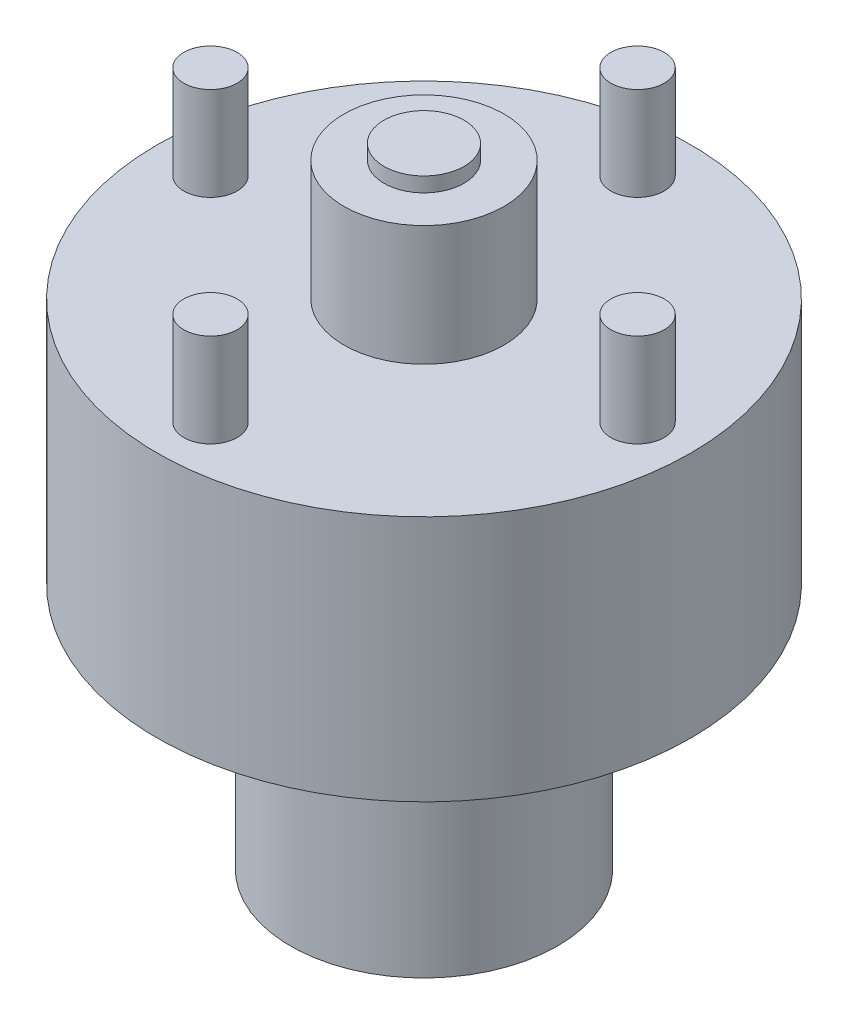
ISO-10303-21;
HEADER;
FILE_DESCRIPTION(('STEP AP214'),'2;1');
FILE_NAME('part.step','',(''),(''),'','','');
FILE_SCHEMA(('AUTOMOTIVE_DESIGN { 1 0 10303 214 1 1 1 1 }'));
ENDSEC;
DATA;
#1=APPLICATION_CONTEXT('core data for automotive mechanical design processes');
#2=APPLICATION_PROTOCOL_DEFINITION('international standard','automotive_design',2000,#1);
#3=PRODUCT_CONTEXT('',#1,'mechanical');
#4=PRODUCT('Part','Part','',(#3));
#5=PRODUCT_RELATED_PRODUCT_CATEGORY('part','',(#4));
#6=PRODUCT_DEFINITION_FORMATION('','',#4);
#7=PRODUCT_DEFINITION_CONTEXT('part definition',#1,'design');
#8=PRODUCT_DEFINITION('design','',#6,#7);
#9=PRODUCT_DEFINITION_SHAPE('','',#8);
#10=(LENGTH_UNIT() NAMED_UNIT(*) SI_UNIT(.MILLI.,.METRE.));
#11=(NAMED_UNIT(*) PLANE_ANGLE_UNIT() SI_UNIT($,.RADIAN.));
#12=(NAMED_UNIT(*) SI_UNIT($,.STERADIAN.) SOLID_ANGLE_UNIT());
#13=UNCERTAINTY_MEASURE_WITH_UNIT(LENGTH_MEASURE(1.E-05),#10,'distance_accuracy_value','');
#14=(GEOMETRIC_REPRESENTATION_CONTEXT(3) GLOBAL_UNCERTAINTY_ASSIGNED_CONTEXT((#13)) GLOBAL_UNIT_ASSIGNED_CONTEXT((#10,
#11,#12)) REPRESENTATION_CONTEXT('',''));
#15=CARTESIAN_POINT('',(0.,0.,0.));
#16=DIRECTION('',(0.,0.,1.));
#17=DIRECTION('',(1.,0.,0.));
#18=AXIS2_PLACEMENT_3D('',#15,#16,#17);
#19=CARTESIAN_POINT('',(0.,14.375,0.));
#20=DIRECTION('',(0.,1.,0.));
#21=DIRECTION('',(-1.,0.,0.));
#22=AXIS2_PLACEMENT_3D('',#19,#20,#21);
#23=PLANE('',#22);
#24=CARTESIAN_POINT('',(0.,14.375,0.));
#25=DIRECTION('',(0.,-1.,0.));
#26=DIRECTION('',(1.,0.,0.));
#27=AXIS2_PLACEMENT_3D('',#24,#25,#26);
#28=CIRCLE('',#27,1.5);
#29=CARTESIAN_POINT('',(1.5,14.375,0.));
#30=VERTEX_POINT('',#29);
#31=EDGE_CURVE('E10',#30,#30,#28,.T.);
#32=ORIENTED_EDGE('',*,*,#31,.F.);
#33=EDGE_LOOP('',(#32));
#34=FACE_BOUND('',#33,.T.);
#35=ADVANCED_FACE('F14',(#34),#23,.T.);
#36=CARTESIAN_POINT('',(0.,-4.325,0.));
#37=DIRECTION('',(0.,-1.,0.));
#38=DIRECTION('',(1.,0.,0.));
#39=AXIS2_PLACEMENT_3D('',#36,#37,#38);
#40=CYLINDRICAL_SURFACE('',#39,1.5);
#41=ORIENTED_EDGE('',*,*,#31,.T.);
#42=EDGE_LOOP('',(#41));
#43=FACE_BOUND('',#42,.T.);
#44=CARTESIAN_POINT('',(0.,13.825,0.));
#45=DIRECTION('',(0.,-1.,0.));
#46=DIRECTION('',(1.,0.,0.));
#47=AXIS2_PLACEMENT_3D('',#44,#45,#46);
#48=CIRCLE('',#47,1.5);
#49=CARTESIAN_POINT('',(1.5,13.825,0.));
#50=VERTEX_POINT('',#49);
#51=EDGE_CURVE('E26',#50,#50,#48,.T.);
#52=ORIENTED_EDGE('',*,*,#51,.F.);
#53=EDGE_LOOP('',(#52));
#54=FACE_BOUND('',#53,.T.);
#55=ADVANCED_FACE('F96',(#43,#54),#40,.T.);
#56=CARTESIAN_POINT('',(1.5,13.825,0.));
#57=DIRECTION('',(0.,1.,0.));
#58=DIRECTION('',(-1.,0.,0.));
#59=AXIS2_PLACEMENT_3D('',#56,#57,#58);
#60=PLANE('',#59);
#61=ORIENTED_EDGE('',*,*,#51,.T.);
#62=EDGE_LOOP('',(#61));
#63=FACE_BOUND('',#62,.T.);
#64=CARTESIAN_POINT('',(0.,13.825,0.));
#65=DIRECTION('',(0.,-1.,0.));
#66=DIRECTION('',(1.,0.,0.));
#67=AXIS2_PLACEMENT_3D('',#64,#65,#66);
#68=CIRCLE('',#67,3.);
#69=CARTESIAN_POINT('',(3.,13.825,0.));
#70=VERTEX_POINT('',#69);
#71=EDGE_CURVE('E30',#70,#70,#68,.T.);
#72=ORIENTED_EDGE('',*,*,#71,.F.);
#73=EDGE_LOOP('',(#72));
#74=FACE_BOUND('',#73,.T.);
#75=ADVANCED_FACE('F101',(#63,#74),#60,.T.);
#76=CARTESIAN_POINT('',(0.,-4.325,0.));
#77=DIRECTION('',(0.,-1.,0.));
#78=DIRECTION('',(1.,0.,0.));
#79=AXIS2_PLACEMENT_3D('',#76,#77,#78);
#80=CYLINDRICAL_SURFACE('',#79,3.);
#81=ORIENTED_EDGE('',*,*,#71,.T.);
#82=EDGE_LOOP('',(#81));
#83=FACE_BOUND('',#82,.T.);
#84=CARTESIAN_POINT('',(0.,9.325,0.));
#85=DIRECTION('',(0.,-1.,0.));
#86=DIRECTION('',(1.,0.,0.));
#87=AXIS2_PLACEMENT_3D('',#84,#85,#86);
#88=CIRCLE('',#87,3.);
#89=CARTESIAN_POINT('',(3.,9.325,0.));
#90=VERTEX_POINT('',#89);
#91=EDGE_CURVE('E35',#90,#90,#88,.T.);
#92=ORIENTED_EDGE('',*,*,#91,.F.);
#93=EDGE_LOOP('',(#92));
#94=FACE_BOUND('',#93,.T.);
#95=ADVANCED_FACE('F105',(#83,#94),#80,.T.);
#96=CARTESIAN_POINT('',(10.,9.325,0.));
#97=DIRECTION('',(0.,1.,0.));
#98=DIRECTION('',(-1.,0.,0.));
#99=AXIS2_PLACEMENT_3D('',#96,#97,#98);
#100=PLANE('',#99);
#101=CARTESIAN_POINT('',(8.,9.325,1.5144976769533E-13));
#102=DIRECTION('',(0.,1.,0.));
#103=DIRECTION('',(-1.,0.,0.));
#104=AXIS2_PLACEMENT_3D('',#101,#102,#103);
#105=CIRCLE('',#104,1.);
#106=CARTESIAN_POINT('',(7.,9.325,1.5144976769533E-13));
#107=VERTEX_POINT('',#106);
#108=EDGE_CURVE('E326',#107,#107,#105,.T.);
#109=ORIENTED_EDGE('',*,*,#108,.F.);
#110=EDGE_LOOP('',(#109));
#111=FACE_BOUND('',#110,.T.);
#112=CARTESIAN_POINT('',(1.21957625001815E-13,9.325,-8.));
#113=DIRECTION('',(0.,1.,0.));
#114=DIRECTION('',(-1.,0.,0.));
#115=AXIS2_PLACEMENT_3D('',#112,#113,#114);
#116=CIRCLE('',#115,1.);
#117=CARTESIAN_POINT('',(-0.999999999999878,9.325,-8.));
#118=VERTEX_POINT('',#117);
#119=EDGE_CURVE('E325',#118,#118,#116,.T.);
#120=ORIENTED_EDGE('',*,*,#119,.F.);
#121=EDGE_LOOP('',(#120));
#122=FACE_BOUND('',#121,.T.);
#123=CARTESIAN_POINT('',(-8.,9.325,0.));
#124=DIRECTION('',(0.,1.,0.));
#125=DIRECTION('',(-1.,0.,0.));
#126=AXIS2_PLACEMENT_3D('',#123,#124,#125);
#127=CIRCLE('',#126,1.);
#128=CARTESIAN_POINT('',(-9.,9.325,0.));
#129=VERTEX_POINT('',#128);
#130=EDGE_CURVE('E335',#129,#129,#127,.T.);
#131=ORIENTED_EDGE('',*,*,#130,.F.);
#132=EDGE_LOOP('',(#131));
#133=FACE_BOUND('',#132,.T.);
#134=CARTESIAN_POINT('',(0.,9.325,8.));
#135=DIRECTION('',(0.,1.,0.));
#136=DIRECTION('',(-1.,0.,0.));
#137=AXIS2_PLACEMENT_3D('',#134,#135,#136);
#138=CIRCLE('',#137,1.);
#139=CARTESIAN_POINT('',(-1.00000000000007,9.325,8.));
#140=VERTEX_POINT('',#139);
#141=EDGE_CURVE('E63',#140,#140,#138,.T.);
#142=ORIENTED_EDGE('',*,*,#141,.F.);
#143=EDGE_LOOP('',(#142));
#144=FACE_BOUND('',#143,.T.);
#145=ORIENTED_EDGE('',*,*,#91,.T.);
#146=EDGE_LOOP('',(#145));
#147=FACE_BOUND('',#146,.T.);
#148=CARTESIAN_POINT('',(0.,9.325,0.));
#149=DIRECTION('',(0.,-1.,0.));
#150=DIRECTION('',(1.,0.,0.));
#151=AXIS2_PLACEMENT_3D('',#148,#149,#150);
#152=CIRCLE('',#151,10.);
#153=CARTESIAN_POINT('',(10.,9.325,0.));
#154=VERTEX_POINT('',#153);
#155=EDGE_CURVE('E38',#154,#154,#152,.T.);
#156=ORIENTED_EDGE('',*,*,#155,.F.);
#157=EDGE_LOOP('',(#156));
#158=FACE_BOUND('',#157,.T.);
#159=ADVANCED_FACE('F112',(#111,#122,#133,#144,#147,#158),#100,.T.);
#160=CARTESIAN_POINT('',(0.,-4.325,0.));
#161=DIRECTION('',(0.,-1.,0.));
#162=DIRECTION('',(1.,0.,0.));
#163=AXIS2_PLACEMENT_3D('',#160,#161,#162);
#164=CYLINDRICAL_SURFACE('',#163,10.);
#165=ORIENTED_EDGE('',*,*,#155,.T.);
#166=EDGE_LOOP('',(#165));
#167=FACE_BOUND('',#166,.T.);
#168=CARTESIAN_POINT('',(0.,0.0749999999999987,0.));
#169=DIRECTION('',(0.,-1.,0.));
#170=DIRECTION('',(1.,0.,0.));
#171=AXIS2_PLACEMENT_3D('',#168,#169,#170);
#172=CIRCLE('',#171,10.);
#173=CARTESIAN_POINT('',(10.,0.0750000000000004,0.));
#174=VERTEX_POINT('',#173);
#175=EDGE_CURVE('E41',#174,#174,#172,.T.);
#176=ORIENTED_EDGE('',*,*,#175,.F.);
#177=EDGE_LOOP('',(#176));
#178=FACE_BOUND('',#177,.T.);
#179=ADVANCED_FACE('F116',(#167,#178),#164,.T.);
#180=CARTESIAN_POINT('',(5.,0.075,0.));
#181=DIRECTION('',(0.,-1.,0.));
#182=DIRECTION('',(1.,0.,0.));
#183=AXIS2_PLACEMENT_3D('',#180,#181,#182);
#184=PLANE('',#183);
#185=ORIENTED_EDGE('',*,*,#175,.T.);
#186=EDGE_LOOP('',(#185));
#187=FACE_BOUND('',#186,.T.);
#188=CARTESIAN_POINT('',(0.,0.075,0.));
#189=DIRECTION('',(0.,-1.,0.));
#190=DIRECTION('',(1.,0.,0.));
#191=AXIS2_PLACEMENT_3D('',#188,#189,#190);
#192=CIRCLE('',#191,5.);
#193=CARTESIAN_POINT('',(5.,0.0750000000000008,0.));
#194=VERTEX_POINT('',#193);
#195=EDGE_CURVE('E44',#194,#194,#192,.T.);
#196=ORIENTED_EDGE('',*,*,#195,.F.);
#197=EDGE_LOOP('',(#196));
#198=FACE_BOUND('',#197,.T.);
#199=ADVANCED_FACE('F92',(#187,#198),#184,.T.);
#200=CARTESIAN_POINT('',(0.,-4.325,0.));
#201=DIRECTION('',(0.,-1.,0.));
#202=DIRECTION('',(1.,0.,0.));
#203=AXIS2_PLACEMENT_3D('',#200,#201,#202);
#204=CYLINDRICAL_SURFACE('',#203,5.);
#205=CARTESIAN_POINT('',(-4.89897948556636,-6.75,-1.));
#206=CARTESIAN_POINT('',(-4.89898059043933,-6.80556437548198,-0.999997945876045));
#207=CARTESIAN_POINT('',(-4.89993508346913,-6.86115462330649,-0.995353171723656));
#208=CARTESIAN_POINT('',(-4.90364431385263,-6.97076250511841,-0.976912283588335));
#209=CARTESIAN_POINT('',(-4.90640049166332,-7.02477884463107,-0.963108847071181));
#210=CARTESIAN_POINT('',(-4.91338873700355,-7.12963730336293,-0.926795782617738));
#211=CARTESIAN_POINT('',(-4.91761933615312,-7.18048252153493,-0.904294814152084));
#212=CARTESIAN_POINT('',(-4.92707799486421,-7.27767484469461,-0.851249107671044));
#213=CARTESIAN_POINT('',(-4.93230599875014,-7.32402220053727,-0.820704818601296));
#214=CARTESIAN_POINT('',(-4.9432529969268,-7.4115610038545,-0.75197907565329));
#215=CARTESIAN_POINT('',(-4.94897737836825,-7.45267958788414,-0.713705655913281));
#216=CARTESIAN_POINT('',(-4.9602247230302,-7.52795753357881,-0.630806789021351));
#217=CARTESIAN_POINT('',(-4.96574767210945,-7.56211640741714,-0.586180896977995));
#218=CARTESIAN_POINT('',(-4.97602796417447,-7.6227880176285,-0.491361355924245));
#219=CARTESIAN_POINT('',(-4.9807782144152,-7.64923151381665,-0.441122567672208));
#220=CARTESIAN_POINT('',(-4.98891736883662,-7.69327493704813,-0.336804150387275));
#221=CARTESIAN_POINT('',(-4.99230640044128,-7.71087569190099,-0.282724881420554));
#222=CARTESIAN_POINT('',(-4.99730320688411,-7.73650719361963,-0.173016773278494));
#223=CARTESIAN_POINT('',(-4.99893386288125,-7.74466097757101,-0.117417739214814));
#224=CARTESIAN_POINT('',(-5.00030921183606,-7.75155095183831,-0.00561856843753665));
#225=CARTESIAN_POINT('',(-5.00005408652759,-7.75028804964582,0.0505815098318431));
#226=CARTESIAN_POINT('',(-4.99770434868515,-7.73847381978444,0.161142000743589));
#227=CARTESIAN_POINT('',(-4.99563598365838,-7.72805502283215,0.21551721429847));
#228=CARTESIAN_POINT('',(-4.98992177159409,-7.69843496754111,0.321731626580302));
#229=CARTESIAN_POINT('',(-4.98627586144039,-7.67923335780813,0.37357072374713));
#230=CARTESIAN_POINT('',(-4.97777296019959,-7.63246995985273,0.473619463200887));
#231=CARTESIAN_POINT('',(-4.97290848175224,-7.60485624889511,0.521804174133899));
#232=CARTESIAN_POINT('',(-4.96250469473785,-7.5420909227634,0.612905045859755));
#233=CARTESIAN_POINT('',(-4.95696530855222,-7.50693844022948,0.655820599525));
#234=CARTESIAN_POINT('',(-4.9457096436446,-7.42936637789153,0.735951431053457));
#235=CARTESIAN_POINT('',(-4.93999196457516,-7.38683081327041,0.773054316573631));
#236=CARTESIAN_POINT('',(-4.92911571598761,-7.29608355754925,0.839618493176807));
#237=CARTESIAN_POINT('',(-4.92395715704548,-7.2478717591168,0.869079639727751));
#238=CARTESIAN_POINT('',(-4.91478047472924,-7.1469791681782,0.919562814801881));
#239=CARTESIAN_POINT('',(-4.91076481563549,-7.09428903236034,0.940566647777709));
#240=CARTESIAN_POINT('',(-4.90436476321273,-6.98602867627601,0.973390341627581));
#241=CARTESIAN_POINT('',(-4.90198015728428,-6.93045883238092,0.985211399456641));
#242=CARTESIAN_POINT('',(-4.89915479267828,-6.81903514200096,0.999166006036051));
#243=CARTESIAN_POINT('',(-4.89868147057154,-6.76320242568966,1.00146185889791));
#244=CARTESIAN_POINT('',(-4.89964485688854,-6.65195177680032,0.996737628310738));
#245=CARTESIAN_POINT('',(-4.90108145700388,-6.59653382088114,0.989718073122442));
#246=CARTESIAN_POINT('',(-4.90567232494915,-6.48823135970776,0.966702208074156));
#247=CARTESIAN_POINT('',(-4.90880999014497,-6.43532765696424,0.950792620839297));
#248=CARTESIAN_POINT('',(-4.91643489351665,-6.33293672097126,0.910541035308517));
#249=CARTESIAN_POINT('',(-4.92092224286269,-6.28344976956428,0.886198342373176));
#250=CARTESIAN_POINT('',(-4.93081405962039,-6.18858689004984,0.829404142215597));
#251=CARTESIAN_POINT('',(-4.93622971864903,-6.14327295369917,0.796851077982752));
#252=CARTESIAN_POINT('',(-4.94733723826636,-6.05869168799908,0.724695572212711));
#253=CARTESIAN_POINT('',(-4.95302912723818,-6.01942498175074,0.685092405144536));
#254=CARTESIAN_POINT('',(-4.96415345869215,-5.94743744081442,0.59923227349789));
#255=CARTESIAN_POINT('',(-4.96958057708684,-5.91482634535,0.55288249892963));
#256=CARTESIAN_POINT('',(-4.9794712762862,-5.85785411850042,0.455267896634755));
#257=CARTESIAN_POINT('',(-4.98393489755211,-5.83349264065522,0.404003275433506));
#258=CARTESIAN_POINT('',(-4.99137294061067,-5.79387112825337,0.298302680824011));
#259=CARTESIAN_POINT('',(-4.99435579142604,-5.77855948177375,0.243886673478076));
#260=CARTESIAN_POINT('',(-4.9985323593766,-5.75730875233615,0.13318945467991));
#261=CARTESIAN_POINT('',(-4.99972629199843,-5.75136854052431,0.0769084687112125));
#262=CARTESIAN_POINT('',(-5.00018540454121,-5.74907301903711,-0.0348728939036245));
#263=CARTESIAN_POINT('',(-4.99948378549351,-5.75255271954379,-0.0903698121415032));
#264=CARTESIAN_POINT('',(-4.99630043560318,-5.76863395054781,-0.199971031315642));
#265=CARTESIAN_POINT('',(-4.99381872714351,-5.78123536634807,-0.254075349753692));
#266=CARTESIAN_POINT('',(-4.98735498365,-5.81512899209164,-0.359252749745098));
#267=CARTESIAN_POINT('',(-4.98337637247912,-5.83640137813118,-0.410332443240283));
#268=CARTESIAN_POINT('',(-4.97434722123382,-5.8870122413309,-0.508221220185954));
#269=CARTESIAN_POINT('',(-4.96929659645878,-5.91635135590372,-0.555029965767412));
#270=CARTESIAN_POINT('',(-4.95857599157868,-5.98281938706208,-0.643863890106359));
#271=CARTESIAN_POINT('',(-4.95289733422142,-6.02006633638677,-0.685799716116506));
#272=CARTESIAN_POINT('',(-4.94161222903622,-6.10105024009578,-0.762882617756848));
#273=CARTESIAN_POINT('',(-4.93600579862875,-6.14478872946874,-0.798028083202714));
#274=CARTESIAN_POINT('',(-4.92543342749964,-6.23807931670018,-0.860892219455201));
#275=CARTESIAN_POINT('',(-4.92047503631328,-6.28768896116037,-0.888526814639769));
#276=CARTESIAN_POINT('',(-4.91185237184445,-6.3909327732997,-0.93502404928781));
#277=CARTESIAN_POINT('',(-4.90818692536957,-6.44456323869792,-0.953894645979291));
#278=CARTESIAN_POINT('',(-4.90329681128922,-6.54026245543657,-0.978669139854273));
#279=CARTESIAN_POINT('',(-4.90168784915661,-6.58178541951146,-0.986653898522986));
#280=CARTESIAN_POINT('',(-4.8995287845803,-6.66553395455364,-0.99732001796041));
#281=CARTESIAN_POINT('',(-4.89897864563277,-6.70775950124817,-1.00000156156205));
#282=CARTESIAN_POINT('',(-4.89897948556636,-6.75,-1.));
#283=B_SPLINE_CURVE_WITH_KNOTS('',3,(#205,#206,#207,#208,#209,#210,#211,#212,#213,#214,#215,
#216,#217,#218,#219,#220,#221,#222,#223,#224,#225,#226,#227,#228,#229,#230,#231,#232,#233,#234,
#235,#236,#237,#238,#239,#240,#241,#242,#243,#244,#245,#246,#247,#248,#249,#250,#251,#252,#253,
#254,#255,#256,#257,#258,#259,#260,#261,#262,#263,#264,#265,#266,#267,#268,#269,#270,#271,#272,
#273,#274,#275,#276,#277,#278,#279,#280,#281,#282),.UNSPECIFIED.,.T.,.F.,(4,2,2,2,2,2,2,2,2,2,2,
2,2,2,2,2,2,2,2,2,2,2,2,2,2,2,2,2,2,2,2,2,2,2,2,2,2,2,4),(0.,0.166538463856524,
0.333210239259265,0.499716497915551,0.666213464834828,0.834822525459333,1.00344340032919,
1.17353400434947,1.34360868244057,1.51144248880577,1.67926012113745,1.84468789631034,
2.01012229071247,2.176599242198,2.34309535767563,2.5124934675998,2.68189478120217,
2.85165863170273,3.02140035013521,3.1882375780209,3.35506534525918,3.52029341780816,
3.68553510351896,3.85293059772018,4.02034332867706,4.19032601730947,4.36030156627602,
4.52929813576147,4.69827434689125,4.86431017412183,5.03034391364254,5.19600017072949,
5.36166952132181,5.53001152023094,5.69839338887278,5.86858898576538,6.0386297508643,
6.16523803634393,6.29184195681711),.UNSPECIFIED.);
#284=CARTESIAN_POINT('',(-4.89897948556636,-6.75,-1.));
#285=VERTEX_POINT('',#284);
#286=EDGE_CURVE('E56',#285,#285,#283,.T.);
#287=ORIENTED_EDGE('',*,*,#286,.F.);
#288=EDGE_LOOP('',(#287));
#289=FACE_BOUND('',#288,.T.);
#290=ORIENTED_EDGE('',*,*,#195,.T.);
#291=EDGE_LOOP('',(#290));
#292=FACE_BOUND('',#291,.T.);
#293=CARTESIAN_POINT('',(0.,-9.175,0.));
#294=DIRECTION('',(0.,-1.,0.));
#295=DIRECTION('',(1.,0.,0.));
#296=AXIS2_PLACEMENT_3D('',#293,#294,#295);
#297=CIRCLE('',#296,5.);
#298=CARTESIAN_POINT('',(5.,-9.175,0.));
#299=VERTEX_POINT('',#298);
#300=EDGE_CURVE('E47',#299,#299,#297,.T.);
#301=ORIENTED_EDGE('',*,*,#300,.F.);
#302=EDGE_LOOP('',(#301));
#303=FACE_BOUND('',#302,.T.);
#304=ADVANCED_FACE('F65',(#289,#292,#303),#204,.T.);
#305=CARTESIAN_POINT('',(2.85,-9.175,0.));
#306=DIRECTION('',(0.,-1.,0.));
#307=DIRECTION('',(1.,0.,0.));
#308=AXIS2_PLACEMENT_3D('',#305,#306,#307);
#309=PLANE('',#308);
#310=ORIENTED_EDGE('',*,*,#300,.T.);
#311=EDGE_LOOP('',(#310));
#312=FACE_BOUND('',#311,.T.);
#313=CARTESIAN_POINT('',(0.,-9.175,0.));
#314=DIRECTION('',(0.,-1.,0.));
#315=DIRECTION('',(1.,0.,0.));
#316=AXIS2_PLACEMENT_3D('',#313,#314,#315);
#317=CIRCLE('',#316,2.85);
#318=CARTESIAN_POINT('',(2.85,-9.175,0.));
#319=VERTEX_POINT('',#318);
#320=EDGE_CURVE('E50',#319,#319,#317,.T.);
#321=ORIENTED_EDGE('',*,*,#320,.F.);
#322=EDGE_LOOP('',(#321));
#323=FACE_BOUND('',#322,.T.);
#324=ADVANCED_FACE('F84',(#312,#323),#309,.T.);
#325=CARTESIAN_POINT('',(0.,-4.325,0.));
#326=DIRECTION('',(0.,-1.,0.));
#327=DIRECTION('',(1.,0.,0.));
#328=AXIS2_PLACEMENT_3D('',#325,#326,#327);
#329=CYLINDRICAL_SURFACE('',#328,2.85);
#330=CARTESIAN_POINT('',(-2.66880122901651,-6.75,-1.));
#331=CARTESIAN_POINT('',(-2.6688004561792,-6.6957195715336,-1.0000009088373));
#332=CARTESIAN_POINT('',(-2.67047529533561,-6.64144547181646,-0.995565595803335));
#333=CARTESIAN_POINT('',(-2.6769540281088,-6.53451694904152,-0.978009750469148));
#334=CARTESIAN_POINT('',(-2.68175816860933,-6.48186265412019,-0.964888532900042));
#335=CARTESIAN_POINT('',(-2.69388577441423,-6.37974264644938,-0.930488003285745));
#336=CARTESIAN_POINT('',(-2.70120386046258,-6.3302703910639,-0.909226099368961));
#337=CARTESIAN_POINT('',(-2.71752663239187,-6.23557750375952,-0.859208192677543));
#338=CARTESIAN_POINT('',(-2.72653174981666,-6.19035796414372,-0.830450271677981));
#339=CARTESIAN_POINT('',(-2.74565220206296,-6.10349109822925,-0.764919380662244));
#340=CARTESIAN_POINT('',(-2.75579731605631,-6.06205499571135,-0.727875033606545));
#341=CARTESIAN_POINT('',(-2.77580433788903,-5.98583727451353,-0.647400626530004));
#342=CARTESIAN_POINT('',(-2.78566619422497,-5.95105685957762,-0.603969413891318));
#343=CARTESIAN_POINT('',(-2.80434404816319,-5.88815556112437,-0.510385631744187));
#344=CARTESIAN_POINT('',(-2.81312099064914,-5.86025936669437,-0.460073552891832));
#345=CARTESIAN_POINT('',(-2.82828636345265,-5.81341182048635,-0.355109291057522));
#346=CARTESIAN_POINT('',(-2.83467551181298,-5.79445777922845,-0.300458418814162));
#347=CARTESIAN_POINT('',(-2.84413430705331,-5.76675879210415,-0.190585056556345));
#348=CARTESIAN_POINT('',(-2.8473215150007,-5.75765127156761,-0.135464284268941));
#349=CARTESIAN_POINT('',(-2.85043649550697,-5.74874737773224,-0.0243908239584998));
#350=CARTESIAN_POINT('',(-2.85036519708511,-5.74894835052763,0.0315616224015104));
#351=CARTESIAN_POINT('',(-2.84704888494739,-5.75843341298816,0.140130655832481));
#352=CARTESIAN_POINT('',(-2.84394173969892,-5.76732293135015,0.192786631831926));
#353=CARTESIAN_POINT('',(-2.83507910339868,-5.79327568266814,0.295805492712652));
#354=CARTESIAN_POINT('',(-2.82932342862927,-5.81033948264387,0.346168218254199));
#355=CARTESIAN_POINT('',(-2.81564310780338,-5.8523670644065,0.443992098179209));
#356=CARTESIAN_POINT('',(-2.80768960652686,-5.87743668848086,0.491403578107379));
#357=CARTESIAN_POINT('',(-2.79043223607277,-5.93467464112633,0.581457940211361));
#358=CARTESIAN_POINT('',(-2.7811279647844,-5.96684508503011,0.624099395682192));
#359=CARTESIAN_POINT('',(-2.7615721871171,-6.03932497584303,0.705742571770237));
#360=CARTESIAN_POINT('',(-2.7512965796386,-6.07996972656193,0.744441295827144));
#361=CARTESIAN_POINT('',(-2.73135409710691,-6.16724998858519,0.814578126149172));
#362=CARTESIAN_POINT('',(-2.72168733842612,-6.21388664000509,0.846014847435269));
#363=CARTESIAN_POINT('',(-2.70391670225723,-6.31288176839945,0.901217580263694));
#364=CARTESIAN_POINT('',(-2.69584274091759,-6.36532524289232,0.924841548429458));
#365=CARTESIAN_POINT('',(-2.68251690935625,-6.47380221034754,0.962815062382638));
#366=CARTESIAN_POINT('',(-2.67726370141958,-6.52983398745576,0.977169005045741));
#367=CARTESIAN_POINT('',(-2.67048203571561,-6.64093606300953,0.995548843444258));
#368=CARTESIAN_POINT('',(-2.66878256966579,-6.69591736983434,1.00004943047604));
#369=CARTESIAN_POINT('',(-2.66882018555498,-6.80586404307055,0.999949776312317));
#370=CARTESIAN_POINT('',(-2.67055655347963,-6.86082941042028,0.995351426003273));
#371=CARTESIAN_POINT('',(-2.67709835294654,-6.96691601797957,0.977612700439236));
#372=CARTESIAN_POINT('',(-2.68177988166501,-7.01810334682837,0.964816814318967));
#373=CARTESIAN_POINT('',(-2.69354382706731,-7.11758916654746,0.931467718376879));
#374=CARTESIAN_POINT('',(-2.70062669740521,-7.16588710953409,0.91091304270516));
#375=CARTESIAN_POINT('',(-2.71669459662099,-7.26005708546383,0.861833575393774));
#376=CARTESIAN_POINT('',(-2.72573641769984,-7.30578956896414,0.833060141845878));
#377=CARTESIAN_POINT('',(-2.74459943317989,-7.39194759906375,0.768634484936977));
#378=CARTESIAN_POINT('',(-2.75442088011829,-7.43237141472647,0.732980027271063));
#379=CARTESIAN_POINT('',(-2.77438046801183,-7.50903358625576,0.653511944888941));
#380=CARTESIAN_POINT('',(-2.7845069051104,-7.54492614721994,0.60936073688974));
#381=CARTESIAN_POINT('',(-2.80341637092162,-7.6088230897007,0.51541188966285));
#382=CARTESIAN_POINT('',(-2.81219942982493,-7.63682764850163,0.465614377372212));
#383=CARTESIAN_POINT('',(-2.82740339743662,-7.68391946329594,0.361960436343255));
#384=CARTESIAN_POINT('',(-2.83383726161722,-7.70305578886157,0.308128305035709));
#385=CARTESIAN_POINT('',(-2.84367108199614,-7.73191216670186,0.197736314625076));
#386=CARTESIAN_POINT('',(-2.84707226607693,-7.74163603006485,0.141177569269197));
#387=CARTESIAN_POINT('',(-2.85035502229535,-7.75101995667176,0.0300845842132699));
#388=CARTESIAN_POINT('',(-2.85040939729414,-7.75117412716316,-0.0244032316871605));
#389=CARTESIAN_POINT('',(-2.8474281140692,-7.74265442761021,-0.132592609972267));
#390=CARTESIAN_POINT('',(-2.84439275373857,-7.73398140862874,-0.186294247649049));
#391=CARTESIAN_POINT('',(-2.83564322909889,-7.70839056721116,-0.290352498452024));
#392=CARTESIAN_POINT('',(-2.82998153536733,-7.69163399239515,-0.340753502067569));
#393=CARTESIAN_POINT('',(-2.81656401936877,-7.65050517199252,-0.438042555692486));
#394=CARTESIAN_POINT('',(-2.80880780739049,-7.62613150901861,-0.48492994987479));
#395=CARTESIAN_POINT('',(-2.79161197017162,-7.56936330613099,-0.575872393051686));
#396=CARTESIAN_POINT('',(-2.78211818998541,-7.53669132596236,-0.619743858208922));
#397=CARTESIAN_POINT('',(-2.76262794495338,-7.46471125159769,-0.701539722736158));
#398=CARTESIAN_POINT('',(-2.75263131202982,-7.42540092805744,-0.739462115958666));
#399=CARTESIAN_POINT('',(-2.73272441983475,-7.33916641684199,-0.810013679639654));
#400=CARTESIAN_POINT('',(-2.7228379392885,-7.29198067097468,-0.842330970110305));
#401=CARTESIAN_POINT('',(-2.70480170290923,-7.19253549775383,-0.898567623674657));
#402=CARTESIAN_POINT('',(-2.69665173524843,-7.14027669036888,-0.922488011291749));
#403=CARTESIAN_POINT('',(-2.68319573762921,-7.03259712792493,-0.9609240878375));
#404=CARTESIAN_POINT('',(-2.67786414119202,-6.97721002696421,-0.9755245817351));
#405=CARTESIAN_POINT('',(-2.67066808381094,-6.86454568729343,-0.995059858128937));
#406=CARTESIAN_POINT('',(-2.66880204440925,-6.8072693211919,-0.999999041118564));
#407=CARTESIAN_POINT('',(-2.66880122901651,-6.75,-1.));
#408=B_SPLINE_CURVE_WITH_KNOTS('',3,(#330,#331,#332,#333,#334,#335,#336,#337,#338,#339,#340,
#341,#342,#343,#344,#345,#346,#347,#348,#349,#350,#351,#352,#353,#354,#355,#356,#357,#358,#359,
#360,#361,#362,#363,#364,#365,#366,#367,#368,#369,#370,#371,#372,#373,#374,#375,#376,#377,#378,
#379,#380,#381,#382,#383,#384,#385,#386,#387,#388,#389,#390,#391,#392,#393,#394,#395,#396,#397,
#398,#399,#400,#401,#402,#403,#404,#405,#406,#407),.UNSPECIFIED.,.T.,.F.,(4,2,2,2,2,2,2,2,2,2,2,
2,2,2,2,2,2,2,2,2,2,2,2,2,2,2,2,2,2,2,2,2,2,2,2,2,2,2,4),(0.,0.162628723538886,
0.325270279096272,0.487565965379972,0.649903223845956,0.818642974618485,0.987413214786567,
1.16112272087991,1.33477994800647,1.50179859816922,1.66876963063309,1.82849438656856,
1.98823022362496,2.15017196700624,2.31216201806398,2.4825439787521,2.65295840720246,
2.82631967049563,2.99959864611489,3.16432708021973,3.32902128504687,3.48721183361133,
3.64543228371552,3.8090664165867,3.97275377199375,4.1453166569414,4.31787566319584,
4.48946812040895,4.66099107105911,4.82365007974097,4.98629340733533,5.14581872013117,
5.30537373508047,5.47119572562199,5.63707351504663,5.81035649891892,5.98361833282314,
6.15528023611822,6.32686393334608),.UNSPECIFIED.);
#409=CARTESIAN_POINT('',(-2.66880122901651,-6.75,-1.));
#410=VERTEX_POINT('',#409);
#411=EDGE_CURVE('E17',#410,#410,#408,.T.);
#412=ORIENTED_EDGE('',*,*,#411,.F.);
#413=EDGE_LOOP('',(#412));
#414=FACE_BOUND('',#413,.T.);
#415=ORIENTED_EDGE('',*,*,#320,.T.);
#416=EDGE_LOOP('',(#415));
#417=FACE_BOUND('',#416,.T.);
#418=CARTESIAN_POINT('',(0.,-4.325,0.));
#419=DIRECTION('',(0.,-1.,0.));
#420=DIRECTION('',(1.,0.,0.));
#421=AXIS2_PLACEMENT_3D('',#418,#419,#420);
#422=CIRCLE('',#421,2.85);
#423=CARTESIAN_POINT('',(2.85,-4.325,0.));
#424=VERTEX_POINT('',#423);
#425=EDGE_CURVE('E53',#424,#424,#422,.T.);
#426=ORIENTED_EDGE('',*,*,#425,.F.);
#427=EDGE_LOOP('',(#426));
#428=FACE_BOUND('',#427,.T.);
#429=ADVANCED_FACE('F80',(#414,#417,#428),#329,.F.);
#430=CARTESIAN_POINT('',(2.85,-4.325,0.));
#431=DIRECTION('',(0.,-1.,0.));
#432=DIRECTION('',(1.,0.,0.));
#433=AXIS2_PLACEMENT_3D('',#430,#431,#432);
#434=PLANE('',#433);
#435=ORIENTED_EDGE('',*,*,#425,.T.);
#436=EDGE_LOOP('',(#435));
#437=FACE_BOUND('',#436,.T.);
#438=ADVANCED_FACE('F75',(#437),#434,.T.);
#439=CARTESIAN_POINT('',(-11.,-6.75,0.));
#440=DIRECTION('',(1.,0.,0.));
#441=DIRECTION('',(0.,0.,-1.));
#442=AXIS2_PLACEMENT_3D('',#439,#440,#441);
#443=CYLINDRICAL_SURFACE('',#442,1.);
#444=ORIENTED_EDGE('',*,*,#286,.T.);
#445=EDGE_LOOP('',(#444));
#446=FACE_BOUND('',#445,.T.);
#447=ORIENTED_EDGE('',*,*,#411,.T.);
#448=EDGE_LOOP('',(#447));
#449=FACE_BOUND('',#448,.T.);
#450=ADVANCED_FACE('F69',(#446,#449),#443,.F.);
#451=CARTESIAN_POINT('',(0.,12.825,8.));
#452=DIRECTION('',(0.,-1.,0.));
#453=DIRECTION('',(1.,0.,0.));
#454=AXIS2_PLACEMENT_3D('',#451,#452,#453);
#455=CYLINDRICAL_SURFACE('',#454,1.);
#456=CARTESIAN_POINT('',(0.,12.825,8.));
#457=DIRECTION('',(0.,1.,0.));
#458=DIRECTION('',(-1.,0.,0.));
#459=AXIS2_PLACEMENT_3D('',#456,#457,#458);
#460=CIRCLE('',#459,1.);
#461=CARTESIAN_POINT('',(-1.00000000000007,12.825,8.));
#462=VERTEX_POINT('',#461);
#463=EDGE_CURVE('E341',#462,#462,#460,.T.);
#464=ORIENTED_EDGE('',*,*,#463,.F.);
#465=EDGE_LOOP('',(#464));
#466=FACE_BOUND('',#465,.T.);
#467=ORIENTED_EDGE('',*,*,#141,.T.);
#468=EDGE_LOOP('',(#467));
#469=FACE_BOUND('',#468,.T.);
#470=ADVANCED_FACE('F74',(#466,#469),#455,.T.);
#471=CARTESIAN_POINT('',(0.,12.825,8.));
#472=DIRECTION('',(0.,1.,0.));
#473=DIRECTION('',(-1.,0.,0.));
#474=AXIS2_PLACEMENT_3D('',#471,#472,#473);
#475=PLANE('',#474);
#476=ORIENTED_EDGE('',*,*,#463,.T.);
#477=EDGE_LOOP('',(#476));
#478=FACE_BOUND('',#477,.T.);
#479=ADVANCED_FACE('F178',(#478),#475,.T.);
#480=CARTESIAN_POINT('',(-8.,12.825,0.));
#481=DIRECTION('',(0.,-1.,0.));
#482=DIRECTION('',(1.,0.,0.));
#483=AXIS2_PLACEMENT_3D('',#480,#481,#482);
#484=CYLINDRICAL_SURFACE('',#483,1.);
#485=CARTESIAN_POINT('',(-8.,12.825,0.));
#486=DIRECTION('',(0.,1.,0.));
#487=DIRECTION('',(-1.,0.,0.));
#488=AXIS2_PLACEMENT_3D('',#485,#486,#487);
#489=CIRCLE('',#488,1.);
#490=CARTESIAN_POINT('',(-9.,12.825,0.));
#491=VERTEX_POINT('',#490);
#492=EDGE_CURVE('E337',#491,#491,#489,.T.);
#493=ORIENTED_EDGE('',*,*,#492,.F.);
#494=EDGE_LOOP('',(#493));
#495=FACE_BOUND('',#494,.T.);
#496=ORIENTED_EDGE('',*,*,#130,.T.);
#497=EDGE_LOOP('',(#496));
#498=FACE_BOUND('',#497,.T.);
#499=ADVANCED_FACE('F188',(#495,#498),#484,.T.);
#500=CARTESIAN_POINT('',(-8.,12.825,0.));
#501=DIRECTION('',(0.,1.,0.));
#502=DIRECTION('',(-1.,0.,0.));
#503=AXIS2_PLACEMENT_3D('',#500,#501,#502);
#504=PLANE('',#503);
#505=ORIENTED_EDGE('',*,*,#492,.T.);
#506=EDGE_LOOP('',(#505));
#507=FACE_BOUND('',#506,.T.);
#508=ADVANCED_FACE('F198',(#507),#504,.T.);
#509=CARTESIAN_POINT('',(1.21528998622113E-13,12.825,-8.));
#510=DIRECTION('',(0.,-1.,0.));
#511=DIRECTION('',(1.,0.,0.));
#512=AXIS2_PLACEMENT_3D('',#509,#510,#511);
#513=CYLINDRICAL_SURFACE('',#512,1.);
#514=CARTESIAN_POINT('',(1.21528998622113E-13,12.825,-8.));
#515=DIRECTION('',(0.,1.,0.));
#516=DIRECTION('',(-1.,0.,0.));
#517=AXIS2_PLACEMENT_3D('',#514,#515,#516);
#518=CIRCLE('',#517,1.);
#519=CARTESIAN_POINT('',(-0.999999999999879,12.825,-8.));
#520=VERTEX_POINT('',#519);
#521=EDGE_CURVE('E329',#520,#520,#518,.T.);
#522=ORIENTED_EDGE('',*,*,#521,.F.);
#523=EDGE_LOOP('',(#522));
#524=FACE_BOUND('',#523,.T.);
#525=ORIENTED_EDGE('',*,*,#119,.T.);
#526=EDGE_LOOP('',(#525));
#527=FACE_BOUND('',#526,.T.);
#528=ADVANCED_FACE('F209',(#524,#527),#513,.T.);
#529=CARTESIAN_POINT('',(1.21528998622113E-13,12.825,-8.));
#530=DIRECTION('',(0.,1.,0.));
#531=DIRECTION('',(-1.,0.,0.));
#532=AXIS2_PLACEMENT_3D('',#529,#530,#531);
#533=PLANE('',#532);
#534=ORIENTED_EDGE('',*,*,#521,.T.);
#535=EDGE_LOOP('',(#534));
#536=FACE_BOUND('',#535,.T.);
#537=ADVANCED_FACE('F220',(#536),#533,.T.);
#538=CARTESIAN_POINT('',(8.,12.825,1.5144976769533E-13));
#539=DIRECTION('',(0.,-1.,0.));
#540=DIRECTION('',(1.,0.,0.));
#541=AXIS2_PLACEMENT_3D('',#538,#539,#540);
#542=CYLINDRICAL_SURFACE('',#541,1.);
#543=CARTESIAN_POINT('',(8.,12.825,1.5144976769533E-13));
#544=DIRECTION('',(0.,1.,0.));
#545=DIRECTION('',(-1.,0.,0.));
#546=AXIS2_PLACEMENT_3D('',#543,#544,#545);
#547=CIRCLE('',#546,1.);
#548=CARTESIAN_POINT('',(7.,12.825,1.5144976769533E-13));
#549=VERTEX_POINT('',#548);
#550=EDGE_CURVE('E324',#549,#549,#547,.T.);
#551=ORIENTED_EDGE('',*,*,#550,.F.);
#552=EDGE_LOOP('',(#551));
#553=FACE_BOUND('',#552,.T.);
#554=ORIENTED_EDGE('',*,*,#108,.T.);
#555=EDGE_LOOP('',(#554));
#556=FACE_BOUND('',#555,.T.);
#557=ADVANCED_FACE('F231',(#553,#556),#542,.T.);
#558=CARTESIAN_POINT('',(8.,12.825,1.5144976769533E-13));
#559=DIRECTION('',(0.,1.,0.));
#560=DIRECTION('',(-1.,0.,0.));
#561=AXIS2_PLACEMENT_3D('',#558,#559,#560);
#562=PLANE('',#561);
#563=ORIENTED_EDGE('',*,*,#550,.T.);
#564=EDGE_LOOP('',(#563));
#565=FACE_BOUND('',#564,.T.);
#566=ADVANCED_FACE('F242',(#565),#562,.T.);
#567=CLOSED_SHELL('',(#35,#55,#75,#95,#159,#179,#199,#304,#324,#429,#438,#450,#470,#479,#499,
#508,#528,#537,#557,#566));
#568=MANIFOLD_SOLID_BREP('B1',#567);
#569=ADVANCED_BREP_SHAPE_REPRESENTATION('',(#18,#568),#14);
#570=SHAPE_DEFINITION_REPRESENTATION(#9,#569);
ENDSEC;
END-ISO-10303-21;
